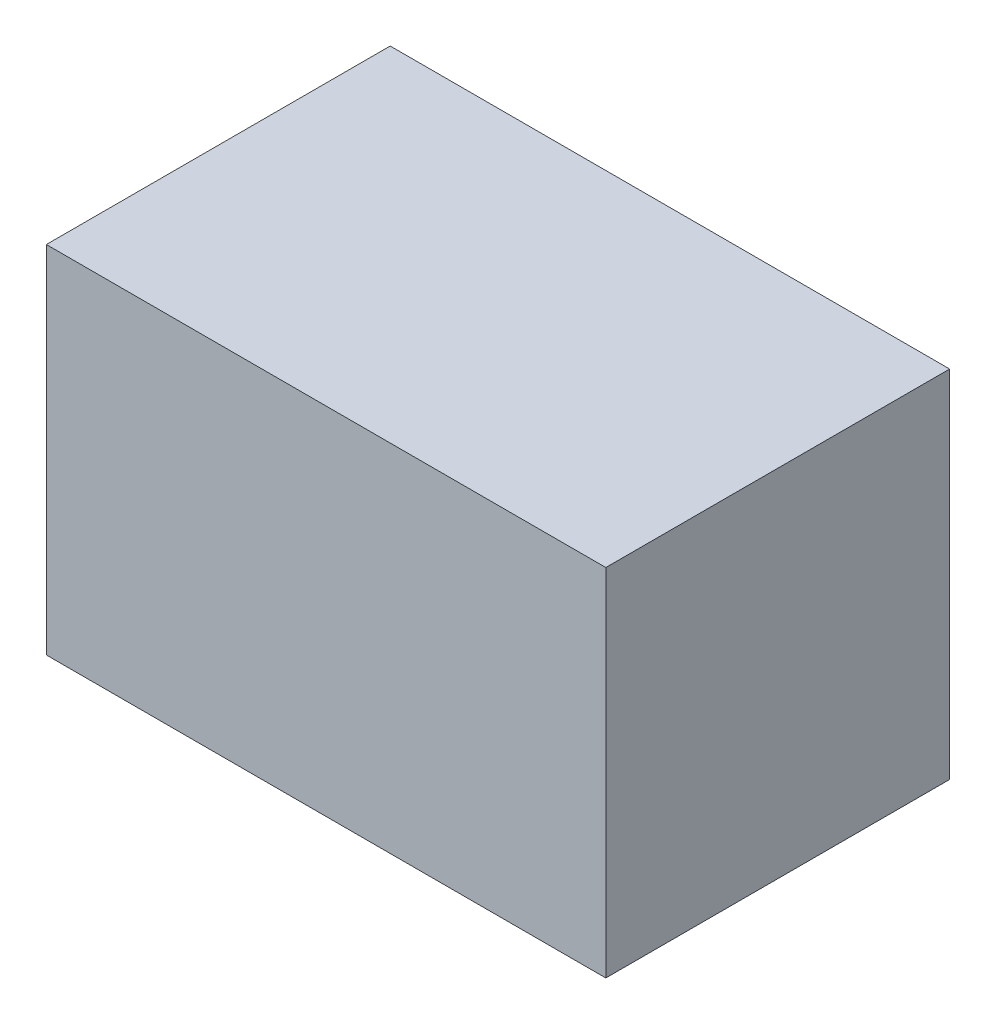
ISO-10303-21;
HEADER;
FILE_DESCRIPTION(('STEP AP214'),'2;1');
FILE_NAME('part.step','',(''),(''),'','','');
FILE_SCHEMA(('AUTOMOTIVE_DESIGN { 1 0 10303 214 1 1 1 1 }'));
ENDSEC;
DATA;
#1=APPLICATION_CONTEXT('core data for automotive mechanical design processes');
#2=APPLICATION_PROTOCOL_DEFINITION('international standard','automotive_design',2000,#1);
#3=PRODUCT_CONTEXT('',#1,'mechanical');
#4=PRODUCT('Part','Part','',(#3));
#5=PRODUCT_RELATED_PRODUCT_CATEGORY('part','',(#4));
#6=PRODUCT_DEFINITION_FORMATION('','',#4);
#7=PRODUCT_DEFINITION_CONTEXT('part definition',#1,'design');
#8=PRODUCT_DEFINITION('design','',#6,#7);
#9=PRODUCT_DEFINITION_SHAPE('','',#8);
#10=(LENGTH_UNIT() NAMED_UNIT(*) SI_UNIT(.MILLI.,.METRE.));
#11=(NAMED_UNIT(*) PLANE_ANGLE_UNIT() SI_UNIT($,.RADIAN.));
#12=(NAMED_UNIT(*) SI_UNIT($,.STERADIAN.) SOLID_ANGLE_UNIT());
#13=UNCERTAINTY_MEASURE_WITH_UNIT(LENGTH_MEASURE(1.E-05),#10,'distance_accuracy_value','');
#14=(GEOMETRIC_REPRESENTATION_CONTEXT(3) GLOBAL_UNCERTAINTY_ASSIGNED_CONTEXT((#13)) GLOBAL_UNIT_ASSIGNED_CONTEXT((#10,
#11,#12)) REPRESENTATION_CONTEXT('',''));
#15=CARTESIAN_POINT('',(0.,0.,0.));
#16=DIRECTION('',(0.,0.,1.));
#17=DIRECTION('',(1.,0.,0.));
#18=AXIS2_PLACEMENT_3D('',#15,#16,#17);
#19=CARTESIAN_POINT('',(0.,193.675,0.));
#20=DIRECTION('',(1.,0.,0.));
#21=DIRECTION('',(0.,0.,-1.));
#22=AXIS2_PLACEMENT_3D('',#19,#20,#21);
#23=PLANE('',#22);
#24=DIRECTION('',(0.,0.,1.));
#25=VECTOR('',#24,1.);
#26=CARTESIAN_POINT('',(0.,0.,0.));
#27=LINE('',#26,#25);
#28=CARTESIAN_POINT('',(0.,0.,-187.325));
#29=VERTEX_POINT('',#28);
#30=CARTESIAN_POINT('',(0.,0.,0.));
#31=VERTEX_POINT('',#30);
#32=EDGE_CURVE('E95',#29,#31,#27,.T.);
#33=ORIENTED_EDGE('',*,*,#32,.T.);
#34=DIRECTION('',(0.,-1.,0.));
#35=VECTOR('',#34,1.);
#36=CARTESIAN_POINT('',(0.,193.675,0.));
#37=LINE('',#36,#35);
#38=CARTESIAN_POINT('',(0.,193.675,0.));
#39=VERTEX_POINT('',#38);
#40=EDGE_CURVE('E11',#39,#31,#37,.T.);
#41=ORIENTED_EDGE('',*,*,#40,.F.);
#42=DIRECTION('',(0.,0.,1.));
#43=VECTOR('',#42,1.);
#44=CARTESIAN_POINT('',(0.,193.675,0.));
#45=LINE('',#44,#43);
#46=CARTESIAN_POINT('',(0.,193.675,-187.325));
#47=VERTEX_POINT('',#46);
#48=EDGE_CURVE('E83',#47,#39,#45,.T.);
#49=ORIENTED_EDGE('',*,*,#48,.F.);
#50=DIRECTION('',(0.,-1.,0.));
#51=VECTOR('',#50,1.);
#52=CARTESIAN_POINT('',(0.,193.675,-187.325));
#53=LINE('',#52,#51);
#54=EDGE_CURVE('E91',#47,#29,#53,.T.);
#55=ORIENTED_EDGE('',*,*,#54,.T.);
#56=EDGE_LOOP('',(#33,#41,#49,#55));
#57=FACE_BOUND('',#56,.T.);
#58=ADVANCED_FACE('F32',(#57),#23,.F.);
#59=CARTESIAN_POINT('',(0.,193.675,0.));
#60=DIRECTION('',(0.,0.,-1.));
#61=DIRECTION('',(-1.,0.,0.));
#62=AXIS2_PLACEMENT_3D('',#59,#60,#61);
#63=PLANE('',#62);
#64=DIRECTION('',(1.,0.,0.));
#65=VECTOR('',#64,1.);
#66=CARTESIAN_POINT('',(0.,0.,0.));
#67=LINE('',#66,#65);
#68=CARTESIAN_POINT('',(304.8,0.,0.));
#69=VERTEX_POINT('',#68);
#70=EDGE_CURVE('E87',#31,#69,#67,.T.);
#71=ORIENTED_EDGE('',*,*,#70,.T.);
#72=DIRECTION('',(0.,-1.,0.));
#73=VECTOR('',#72,1.);
#74=CARTESIAN_POINT('',(304.8,193.675,0.));
#75=LINE('',#74,#73);
#76=CARTESIAN_POINT('',(304.8,193.675,0.));
#77=VERTEX_POINT('',#76);
#78=EDGE_CURVE('E40',#77,#69,#75,.T.);
#79=ORIENTED_EDGE('',*,*,#78,.F.);
#80=DIRECTION('',(1.,0.,0.));
#81=VECTOR('',#80,1.);
#82=CARTESIAN_POINT('',(0.,193.675,0.));
#83=LINE('',#82,#81);
#84=EDGE_CURVE('E78',#39,#77,#83,.T.);
#85=ORIENTED_EDGE('',*,*,#84,.F.);
#86=ORIENTED_EDGE('',*,*,#40,.T.);
#87=EDGE_LOOP('',(#71,#79,#85,#86));
#88=FACE_BOUND('',#87,.T.);
#89=ADVANCED_FACE('F86',(#88),#63,.F.);
#90=CARTESIAN_POINT('',(304.8,193.675,0.));
#91=DIRECTION('',(-1.,0.,0.));
#92=DIRECTION('',(0.,0.,1.));
#93=AXIS2_PLACEMENT_3D('',#90,#91,#92);
#94=PLANE('',#93);
#95=DIRECTION('',(0.,0.,-1.));
#96=VECTOR('',#95,1.);
#97=CARTESIAN_POINT('',(304.8,0.,0.));
#98=LINE('',#97,#96);
#99=CARTESIAN_POINT('',(304.8,0.,-187.325));
#100=VERTEX_POINT('',#99);
#101=EDGE_CURVE('E65',#69,#100,#98,.T.);
#102=ORIENTED_EDGE('',*,*,#101,.T.);
#103=DIRECTION('',(0.,-1.,0.));
#104=VECTOR('',#103,1.);
#105=CARTESIAN_POINT('',(304.8,193.675,-187.325));
#106=LINE('',#105,#104);
#107=CARTESIAN_POINT('',(304.8,193.675,-187.325));
#108=VERTEX_POINT('',#107);
#109=EDGE_CURVE('E88',#108,#100,#106,.T.);
#110=ORIENTED_EDGE('',*,*,#109,.F.);
#111=DIRECTION('',(0.,0.,-1.));
#112=VECTOR('',#111,1.);
#113=CARTESIAN_POINT('',(304.8,193.675,0.));
#114=LINE('',#113,#112);
#115=EDGE_CURVE('E81',#77,#108,#114,.T.);
#116=ORIENTED_EDGE('',*,*,#115,.F.);
#117=ORIENTED_EDGE('',*,*,#78,.T.);
#118=EDGE_LOOP('',(#102,#110,#116,#117));
#119=FACE_BOUND('',#118,.T.);
#120=ADVANCED_FACE('F89',(#119),#94,.F.);
#121=CARTESIAN_POINT('',(0.,193.675,-187.325));
#122=DIRECTION('',(0.,0.,1.));
#123=DIRECTION('',(1.,0.,0.));
#124=AXIS2_PLACEMENT_3D('',#121,#122,#123);
#125=PLANE('',#124);
#126=DIRECTION('',(-1.,0.,0.));
#127=VECTOR('',#126,1.);
#128=CARTESIAN_POINT('',(0.,0.,-187.325));
#129=LINE('',#128,#127);
#130=EDGE_CURVE('E71',#100,#29,#129,.T.);
#131=ORIENTED_EDGE('',*,*,#130,.T.);
#132=ORIENTED_EDGE('',*,*,#54,.F.);
#133=DIRECTION('',(-1.,0.,0.));
#134=VECTOR('',#133,1.);
#135=CARTESIAN_POINT('',(0.,193.675,-187.325));
#136=LINE('',#135,#134);
#137=EDGE_CURVE('E48',#108,#47,#136,.T.);
#138=ORIENTED_EDGE('',*,*,#137,.F.);
#139=ORIENTED_EDGE('',*,*,#109,.T.);
#140=EDGE_LOOP('',(#131,#132,#138,#139));
#141=FACE_BOUND('',#140,.T.);
#142=ADVANCED_FACE('F102',(#141),#125,.F.);
#143=CARTESIAN_POINT('',(0.,193.675,0.));
#144=DIRECTION('',(0.,-1.,0.));
#145=DIRECTION('',(0.,0.,-1.));
#146=AXIS2_PLACEMENT_3D('',#143,#144,#145);
#147=PLANE('',#146);
#148=ORIENTED_EDGE('',*,*,#48,.T.);
#149=ORIENTED_EDGE('',*,*,#84,.T.);
#150=ORIENTED_EDGE('',*,*,#115,.T.);
#151=ORIENTED_EDGE('',*,*,#137,.T.);
#152=EDGE_LOOP('',(#148,#149,#150,#151));
#153=FACE_BOUND('',#152,.T.);
#154=ADVANCED_FACE('F79',(#153),#147,.F.);
#155=CARTESIAN_POINT('',(0.,0.,0.));
#156=DIRECTION('',(0.,-1.,0.));
#157=DIRECTION('',(0.,0.,-1.));
#158=AXIS2_PLACEMENT_3D('',#155,#156,#157);
#159=PLANE('',#158);
#160=ORIENTED_EDGE('',*,*,#32,.F.);
#161=ORIENTED_EDGE('',*,*,#130,.F.);
#162=ORIENTED_EDGE('',*,*,#101,.F.);
#163=ORIENTED_EDGE('',*,*,#70,.F.);
#164=EDGE_LOOP('',(#160,#161,#162,#163));
#165=FACE_BOUND('',#164,.T.);
#166=ADVANCED_FACE('F105',(#165),#159,.T.);
#167=CLOSED_SHELL('',(#58,#89,#120,#142,#154,#166));
#168=MANIFOLD_SOLID_BREP('B2',#167);
#169=ADVANCED_BREP_SHAPE_REPRESENTATION('',(#18,#168),#14);
#170=SHAPE_DEFINITION_REPRESENTATION(#9,#169);
ENDSEC;
END-ISO-10303-21;
